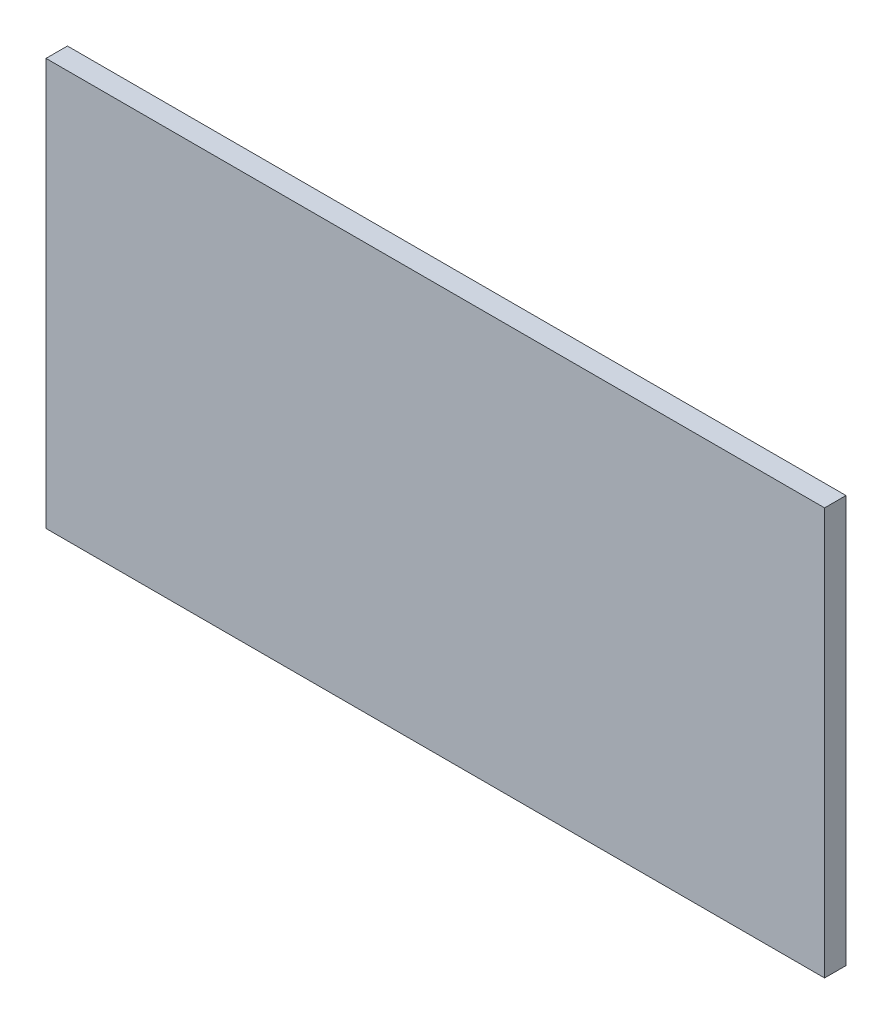
ISO-10303-21;
HEADER;
FILE_DESCRIPTION(('STEP AP214'),'2;1');
FILE_NAME('part.step','',(''),(''),'','','');
FILE_SCHEMA(('AUTOMOTIVE_DESIGN { 1 0 10303 214 1 1 1 1 }'));
ENDSEC;
DATA;
#1=APPLICATION_CONTEXT('core data for automotive mechanical design processes');
#2=APPLICATION_PROTOCOL_DEFINITION('international standard','automotive_design',2000,#1);
#3=PRODUCT_CONTEXT('',#1,'mechanical');
#4=PRODUCT('Part','Part','',(#3));
#5=PRODUCT_RELATED_PRODUCT_CATEGORY('part','',(#4));
#6=PRODUCT_DEFINITION_FORMATION('','',#4);
#7=PRODUCT_DEFINITION_CONTEXT('part definition',#1,'design');
#8=PRODUCT_DEFINITION('design','',#6,#7);
#9=PRODUCT_DEFINITION_SHAPE('','',#8);
#10=(LENGTH_UNIT() NAMED_UNIT(*) SI_UNIT(.MILLI.,.METRE.));
#11=(NAMED_UNIT(*) PLANE_ANGLE_UNIT() SI_UNIT($,.RADIAN.));
#12=(NAMED_UNIT(*) SI_UNIT($,.STERADIAN.) SOLID_ANGLE_UNIT());
#13=UNCERTAINTY_MEASURE_WITH_UNIT(LENGTH_MEASURE(1.E-05),#10,'distance_accuracy_value','');
#14=(GEOMETRIC_REPRESENTATION_CONTEXT(3) GLOBAL_UNCERTAINTY_ASSIGNED_CONTEXT((#13)) GLOBAL_UNIT_ASSIGNED_CONTEXT((#10,
#11,#12)) REPRESENTATION_CONTEXT('',''));
#15=CARTESIAN_POINT('',(0.,0.,0.));
#16=DIRECTION('',(0.,0.,1.));
#17=DIRECTION('',(1.,0.,0.));
#18=AXIS2_PLACEMENT_3D('',#15,#16,#17);
#19=CARTESIAN_POINT('',(0.,2.1316282072803E-11,300.000000000001));
#20=DIRECTION('',(-1.,0.,0.));
#21=DIRECTION('',(0.,0.,1.));
#22=AXIS2_PLACEMENT_3D('',#19,#20,#21);
#23=PLANE('',#22);
#24=DIRECTION('',(0.,1.,0.));
#25=VECTOR('',#24,1.);
#26=CARTESIAN_POINT('',(0.,2.1316282072803E-11,0.));
#27=LINE('',#26,#25);
#28=CARTESIAN_POINT('',(0.,2.1316282072803E-11,0.));
#29=VERTEX_POINT('',#28);
#30=CARTESIAN_POINT('',(0.,5700.00000000002,-1.24344978758018E-11));
#31=VERTEX_POINT('',#30);
#32=EDGE_CURVE('E93',#29,#31,#27,.T.);
#33=ORIENTED_EDGE('',*,*,#32,.T.);
#34=DIRECTION('',(0.,0.,-1.));
#35=VECTOR('',#34,1.);
#36=CARTESIAN_POINT('',(0.,5700.00000000002,299.999999999992));
#37=LINE('',#36,#35);
#38=CARTESIAN_POINT('',(0.,5700.00000000002,299.999999999992));
#39=VERTEX_POINT('',#38);
#40=EDGE_CURVE('E11',#39,#31,#37,.T.);
#41=ORIENTED_EDGE('',*,*,#40,.F.);
#42=DIRECTION('',(0.,1.,0.));
#43=VECTOR('',#42,1.);
#44=CARTESIAN_POINT('',(0.,2.1316282072803E-11,300.000000000001));
#45=LINE('',#44,#43);
#46=CARTESIAN_POINT('',(0.,2.1316282072803E-11,300.000000000001));
#47=VERTEX_POINT('',#46);
#48=EDGE_CURVE('E81',#47,#39,#45,.T.);
#49=ORIENTED_EDGE('',*,*,#48,.F.);
#50=DIRECTION('',(0.,0.,-1.));
#51=VECTOR('',#50,1.);
#52=CARTESIAN_POINT('',(0.,2.1316282072803E-11,300.000000000001));
#53=LINE('',#52,#51);
#54=EDGE_CURVE('E89',#47,#29,#53,.T.);
#55=ORIENTED_EDGE('',*,*,#54,.T.);
#56=EDGE_LOOP('',(#33,#41,#49,#55));
#57=FACE_BOUND('',#56,.T.);
#58=ADVANCED_FACE('F30',(#57),#23,.F.);
#59=CARTESIAN_POINT('',(0.,5700.00000000002,299.999999999992));
#60=DIRECTION('',(0.,-1.,0.));
#61=DIRECTION('',(1.,0.,0.));
#62=AXIS2_PLACEMENT_3D('',#59,#60,#61);
#63=PLANE('',#62);
#64=DIRECTION('',(-1.,0.,0.));
#65=VECTOR('',#64,1.);
#66=CARTESIAN_POINT('',(0.,5700.00000000002,-1.24344978758018E-11));
#67=LINE('',#66,#65);
#68=CARTESIAN_POINT('',(-10900.,5700.00000000003,0.));
#69=VERTEX_POINT('',#68);
#70=EDGE_CURVE('E85',#31,#69,#67,.T.);
#71=ORIENTED_EDGE('',*,*,#70,.T.);
#72=DIRECTION('',(0.,0.,-1.));
#73=VECTOR('',#72,1.);
#74=CARTESIAN_POINT('',(-10900.,5700.00000000003,300.000000000001));
#75=LINE('',#74,#73);
#76=CARTESIAN_POINT('',(-10900.,5700.00000000003,300.000000000001));
#77=VERTEX_POINT('',#76);
#78=EDGE_CURVE('E38',#77,#69,#75,.T.);
#79=ORIENTED_EDGE('',*,*,#78,.F.);
#80=DIRECTION('',(-1.,0.,0.));
#81=VECTOR('',#80,1.);
#82=CARTESIAN_POINT('',(0.,5700.00000000002,299.999999999992));
#83=LINE('',#82,#81);
#84=EDGE_CURVE('E76',#39,#77,#83,.T.);
#85=ORIENTED_EDGE('',*,*,#84,.F.);
#86=ORIENTED_EDGE('',*,*,#40,.T.);
#87=EDGE_LOOP('',(#71,#79,#85,#86));
#88=FACE_BOUND('',#87,.T.);
#89=ADVANCED_FACE('F84',(#88),#63,.F.);
#90=CARTESIAN_POINT('',(-10900.,0.,300.000000000001));
#91=DIRECTION('',(1.,0.,0.));
#92=DIRECTION('',(0.,0.,-1.));
#93=AXIS2_PLACEMENT_3D('',#90,#91,#92);
#94=PLANE('',#93);
#95=DIRECTION('',(0.,-1.,0.));
#96=VECTOR('',#95,1.);
#97=CARTESIAN_POINT('',(-10900.,0.,0.));
#98=LINE('',#97,#96);
#99=CARTESIAN_POINT('',(-10900.,0.,0.));
#100=VERTEX_POINT('',#99);
#101=EDGE_CURVE('E63',#69,#100,#98,.T.);
#102=ORIENTED_EDGE('',*,*,#101,.T.);
#103=DIRECTION('',(0.,0.,-1.));
#104=VECTOR('',#103,1.);
#105=CARTESIAN_POINT('',(-10900.,0.,300.000000000001));
#106=LINE('',#105,#104);
#107=CARTESIAN_POINT('',(-10900.,0.,300.000000000001));
#108=VERTEX_POINT('',#107);
#109=EDGE_CURVE('E86',#108,#100,#106,.T.);
#110=ORIENTED_EDGE('',*,*,#109,.F.);
#111=DIRECTION('',(0.,-1.,0.));
#112=VECTOR('',#111,1.);
#113=CARTESIAN_POINT('',(-10900.,0.,300.000000000001));
#114=LINE('',#113,#112);
#115=EDGE_CURVE('E79',#77,#108,#114,.T.);
#116=ORIENTED_EDGE('',*,*,#115,.F.);
#117=ORIENTED_EDGE('',*,*,#78,.T.);
#118=EDGE_LOOP('',(#102,#110,#116,#117));
#119=FACE_BOUND('',#118,.T.);
#120=ADVANCED_FACE('F87',(#119),#94,.F.);
#121=CARTESIAN_POINT('',(0.,2.1316282072803E-11,300.000000000001));
#122=DIRECTION('',(0.,1.,0.));
#123=DIRECTION('',(-1.,0.,0.));
#124=AXIS2_PLACEMENT_3D('',#121,#122,#123);
#125=PLANE('',#124);
#126=DIRECTION('',(1.,0.,0.));
#127=VECTOR('',#126,1.);
#128=CARTESIAN_POINT('',(0.,2.1316282072803E-11,0.));
#129=LINE('',#128,#127);
#130=EDGE_CURVE('E69',#100,#29,#129,.T.);
#131=ORIENTED_EDGE('',*,*,#130,.T.);
#132=ORIENTED_EDGE('',*,*,#54,.F.);
#133=DIRECTION('',(1.,0.,0.));
#134=VECTOR('',#133,1.);
#135=CARTESIAN_POINT('',(0.,2.1316282072803E-11,300.000000000001));
#136=LINE('',#135,#134);
#137=EDGE_CURVE('E46',#108,#47,#136,.T.);
#138=ORIENTED_EDGE('',*,*,#137,.F.);
#139=ORIENTED_EDGE('',*,*,#109,.T.);
#140=EDGE_LOOP('',(#131,#132,#138,#139));
#141=FACE_BOUND('',#140,.T.);
#142=ADVANCED_FACE('F100',(#141),#125,.F.);
#143=CARTESIAN_POINT('',(0.,5700.00000000002,299.999999999992));
#144=DIRECTION('',(0.,0.,1.));
#145=DIRECTION('',(1.,0.,0.));
#146=AXIS2_PLACEMENT_3D('',#143,#144,#145);
#147=PLANE('',#146);
#148=ORIENTED_EDGE('',*,*,#48,.T.);
#149=ORIENTED_EDGE('',*,*,#84,.T.);
#150=ORIENTED_EDGE('',*,*,#115,.T.);
#151=ORIENTED_EDGE('',*,*,#137,.T.);
#152=EDGE_LOOP('',(#148,#149,#150,#151));
#153=FACE_BOUND('',#152,.T.);
#154=ADVANCED_FACE('F77',(#153),#147,.T.);
#155=CARTESIAN_POINT('',(0.,5700.00000000002,-1.24344978758018E-11));
#156=DIRECTION('',(0.,0.,1.));
#157=DIRECTION('',(1.,0.,0.));
#158=AXIS2_PLACEMENT_3D('',#155,#156,#157);
#159=PLANE('',#158);
#160=ORIENTED_EDGE('',*,*,#32,.F.);
#161=ORIENTED_EDGE('',*,*,#130,.F.);
#162=ORIENTED_EDGE('',*,*,#101,.F.);
#163=ORIENTED_EDGE('',*,*,#70,.F.);
#164=EDGE_LOOP('',(#160,#161,#162,#163));
#165=FACE_BOUND('',#164,.T.);
#166=ADVANCED_FACE('F103',(#165),#159,.F.);
#167=CLOSED_SHELL('',(#58,#89,#120,#142,#154,#166));
#168=MANIFOLD_SOLID_BREP('B2',#167);
#169=ADVANCED_BREP_SHAPE_REPRESENTATION('',(#18,#168),#14);
#170=SHAPE_DEFINITION_REPRESENTATION(#9,#169);
ENDSEC;
END-ISO-10303-21;
